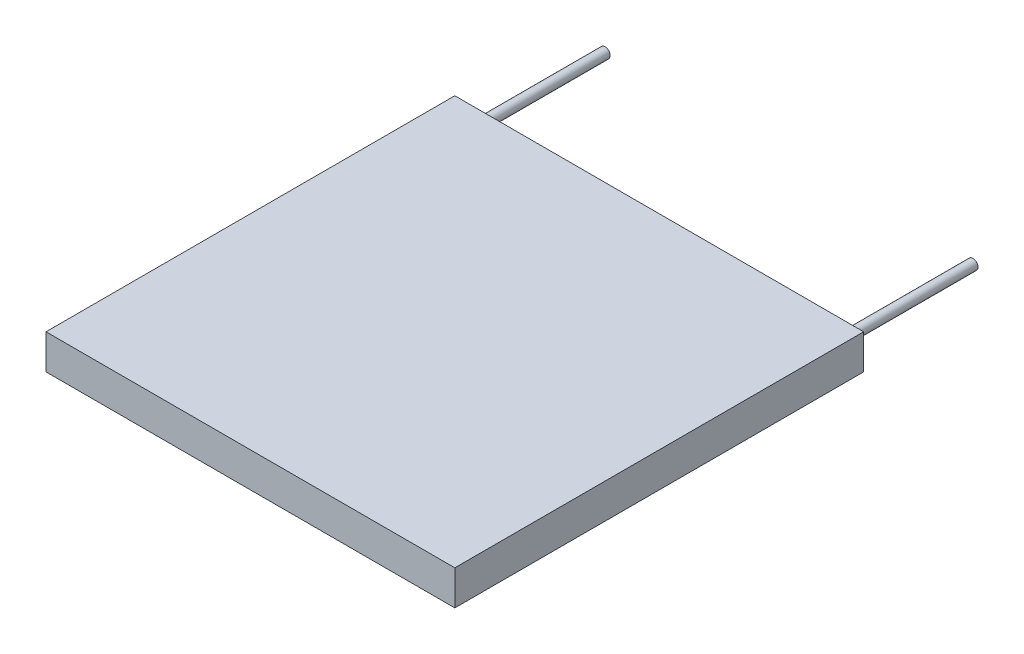
ISO-10303-21;
HEADER;
FILE_DESCRIPTION(('STEP AP214'),'2;1');
FILE_NAME('part.step','',(''),(''),'','','');
FILE_SCHEMA(('AUTOMOTIVE_DESIGN { 1 0 10303 214 1 1 1 1 }'));
ENDSEC;
DATA;
#1=APPLICATION_CONTEXT('core data for automotive mechanical design processes');
#2=APPLICATION_PROTOCOL_DEFINITION('international standard','automotive_design',2000,#1);
#3=PRODUCT_CONTEXT('',#1,'mechanical');
#4=PRODUCT('Part','Part','',(#3));
#5=PRODUCT_RELATED_PRODUCT_CATEGORY('part','',(#4));
#6=PRODUCT_DEFINITION_FORMATION('','',#4);
#7=PRODUCT_DEFINITION_CONTEXT('part definition',#1,'design');
#8=PRODUCT_DEFINITION('design','',#6,#7);
#9=PRODUCT_DEFINITION_SHAPE('','',#8);
#10=(LENGTH_UNIT() NAMED_UNIT(*) SI_UNIT(.MILLI.,.METRE.));
#11=(NAMED_UNIT(*) PLANE_ANGLE_UNIT() SI_UNIT($,.RADIAN.));
#12=(NAMED_UNIT(*) SI_UNIT($,.STERADIAN.) SOLID_ANGLE_UNIT());
#13=UNCERTAINTY_MEASURE_WITH_UNIT(LENGTH_MEASURE(1.E-05),#10,'distance_accuracy_value','');
#14=(GEOMETRIC_REPRESENTATION_CONTEXT(3) GLOBAL_UNCERTAINTY_ASSIGNED_CONTEXT((#13)) GLOBAL_UNIT_ASSIGNED_CONTEXT((#10,
#11,#12)) REPRESENTATION_CONTEXT('',''));
#15=CARTESIAN_POINT('',(0.,0.,0.));
#16=DIRECTION('',(0.,0.,1.));
#17=DIRECTION('',(1.,0.,0.));
#18=AXIS2_PLACEMENT_3D('',#15,#16,#17);
#19=CARTESIAN_POINT('',(-50.6718714377068,3.4,-27.0594687609523));
#20=DIRECTION('',(0.,0.,1.));
#21=DIRECTION('',(1.,0.,0.));
#22=AXIS2_PLACEMENT_3D('',#19,#20,#21);
#23=PLANE('',#22);
#24=CARTESIAN_POINT('',(-48.6718714377068,1.7,-27.0594687609523));
#25=DIRECTION('',(0.,0.,1.));
#26=DIRECTION('',(1.,0.,0.));
#27=AXIS2_PLACEMENT_3D('',#24,#25,#26);
#28=CIRCLE('',#27,0.499999999999999);
#29=CARTESIAN_POINT('',(-48.1718714377068,1.7,-27.0594687609523));
#30=VERTEX_POINT('',#29);
#31=EDGE_CURVE('E43',#30,#30,#28,.F.);
#32=ORIENTED_EDGE('',*,*,#31,.F.);
#33=EDGE_LOOP('',(#32));
#34=FACE_BOUND('',#33,.T.);
#35=DIRECTION('',(-1.,0.,0.));
#36=VECTOR('',#35,1.);
#37=CARTESIAN_POINT('',(-50.6718714377068,0.,-27.0594687609523));
#38=LINE('',#37,#36);
#39=CARTESIAN_POINT('',(-10.6718714377068,0.,-27.0594687609523));
#40=VERTEX_POINT('',#39);
#41=CARTESIAN_POINT('',(-50.6718714377068,0.,-27.0594687609523));
#42=VERTEX_POINT('',#41);
#43=EDGE_CURVE('E74',#40,#42,#38,.T.);
#44=ORIENTED_EDGE('',*,*,#43,.T.);
#45=DIRECTION('',(0.,-1.,0.));
#46=VECTOR('',#45,1.);
#47=CARTESIAN_POINT('',(-50.6718714377068,3.4,-27.0594687609523));
#48=LINE('',#47,#46);
#49=CARTESIAN_POINT('',(-50.6718714377068,3.4,-27.0594687609523));
#50=VERTEX_POINT('',#49);
#51=EDGE_CURVE('E98',#50,#42,#48,.T.);
#52=ORIENTED_EDGE('',*,*,#51,.F.);
#53=DIRECTION('',(-1.,0.,0.));
#54=VECTOR('',#53,1.);
#55=CARTESIAN_POINT('',(-50.6718714377068,3.4,-27.0594687609523));
#56=LINE('',#55,#54);
#57=CARTESIAN_POINT('',(-10.6718714377068,3.4,-27.0594687609523));
#58=VERTEX_POINT('',#57);
#59=EDGE_CURVE('E51',#58,#50,#56,.T.);
#60=ORIENTED_EDGE('',*,*,#59,.F.);
#61=DIRECTION('',(0.,-1.,0.));
#62=VECTOR('',#61,1.);
#63=CARTESIAN_POINT('',(-10.6718714377068,3.4,-27.0594687609523));
#64=LINE('',#63,#62);
#65=EDGE_CURVE('E94',#58,#40,#64,.T.);
#66=ORIENTED_EDGE('',*,*,#65,.T.);
#67=EDGE_LOOP('',(#44,#52,#60,#66));
#68=FACE_BOUND('',#67,.T.);
#69=CARTESIAN_POINT('',(-12.6784714377068,1.77200911665665,-27.0594687609523));
#70=DIRECTION('',(0.,0.,1.));
#71=DIRECTION('',(1.,0.,0.));
#72=AXIS2_PLACEMENT_3D('',#69,#70,#71);
#73=CIRCLE('',#72,0.495300000000001);
#74=CARTESIAN_POINT('',(-12.1831714377068,1.77200911665665,-27.0594687609523));
#75=VERTEX_POINT('',#74);
#76=EDGE_CURVE('E11',#75,#75,#73,.F.);
#77=ORIENTED_EDGE('',*,*,#76,.F.);
#78=EDGE_LOOP('',(#77));
#79=FACE_BOUND('',#78,.T.);
#80=ADVANCED_FACE('F34',(#34,#68,#79),#23,.F.);
#81=CARTESIAN_POINT('',(-50.6718714377068,3.4,-27.0594687609523));
#82=DIRECTION('',(1.,0.,0.));
#83=DIRECTION('',(0.,0.,-1.));
#84=AXIS2_PLACEMENT_3D('',#81,#82,#83);
#85=PLANE('',#84);
#86=DIRECTION('',(0.,0.,1.));
#87=VECTOR('',#86,1.);
#88=CARTESIAN_POINT('',(-50.6718714377068,0.,-27.0594687609523));
#89=LINE('',#88,#87);
#90=CARTESIAN_POINT('',(-50.6718714377068,0.,12.9405312390477));
#91=VERTEX_POINT('',#90);
#92=EDGE_CURVE('E102',#42,#91,#89,.T.);
#93=ORIENTED_EDGE('',*,*,#92,.T.);
#94=DIRECTION('',(0.,-1.,0.));
#95=VECTOR('',#94,1.);
#96=CARTESIAN_POINT('',(-50.6718714377068,3.4,12.9405312390477));
#97=LINE('',#96,#95);
#98=CARTESIAN_POINT('',(-50.6718714377068,3.4,12.9405312390477));
#99=VERTEX_POINT('',#98);
#100=EDGE_CURVE('E93',#99,#91,#97,.T.);
#101=ORIENTED_EDGE('',*,*,#100,.F.);
#102=DIRECTION('',(0.,0.,1.));
#103=VECTOR('',#102,1.);
#104=CARTESIAN_POINT('',(-50.6718714377068,3.4,-27.0594687609523));
#105=LINE('',#104,#103);
#106=EDGE_CURVE('E87',#50,#99,#105,.T.);
#107=ORIENTED_EDGE('',*,*,#106,.F.);
#108=ORIENTED_EDGE('',*,*,#51,.T.);
#109=EDGE_LOOP('',(#93,#101,#107,#108));
#110=FACE_BOUND('',#109,.T.);
#111=ADVANCED_FACE('F36',(#110),#85,.F.);
#112=CARTESIAN_POINT('',(-50.6718714377068,3.4,12.9405312390477));
#113=DIRECTION('',(0.,0.,-1.));
#114=DIRECTION('',(-1.,0.,0.));
#115=AXIS2_PLACEMENT_3D('',#112,#113,#114);
#116=PLANE('',#115);
#117=DIRECTION('',(1.,0.,0.));
#118=VECTOR('',#117,1.);
#119=CARTESIAN_POINT('',(-50.6718714377068,0.,12.9405312390477));
#120=LINE('',#119,#118);
#121=CARTESIAN_POINT('',(-10.6718714377068,0.,12.9405312390477));
#122=VERTEX_POINT('',#121);
#123=EDGE_CURVE('E92',#91,#122,#120,.T.);
#124=ORIENTED_EDGE('',*,*,#123,.T.);
#125=DIRECTION('',(0.,-1.,0.));
#126=VECTOR('',#125,1.);
#127=CARTESIAN_POINT('',(-10.6718714377068,3.4,12.9405312390477));
#128=LINE('',#127,#126);
#129=CARTESIAN_POINT('',(-10.6718714377068,3.4,12.9405312390477));
#130=VERTEX_POINT('',#129);
#131=EDGE_CURVE('E90',#130,#122,#128,.T.);
#132=ORIENTED_EDGE('',*,*,#131,.F.);
#133=DIRECTION('',(1.,0.,0.));
#134=VECTOR('',#133,1.);
#135=CARTESIAN_POINT('',(-50.6718714377068,3.4,12.9405312390477));
#136=LINE('',#135,#134);
#137=EDGE_CURVE('E82',#99,#130,#136,.T.);
#138=ORIENTED_EDGE('',*,*,#137,.F.);
#139=ORIENTED_EDGE('',*,*,#100,.T.);
#140=EDGE_LOOP('',(#124,#132,#138,#139));
#141=FACE_BOUND('',#140,.T.);
#142=ADVANCED_FACE('F91',(#141),#116,.F.);
#143=CARTESIAN_POINT('',(-10.6718714377068,3.4,-27.0594687609523));
#144=DIRECTION('',(-1.,0.,0.));
#145=DIRECTION('',(0.,0.,1.));
#146=AXIS2_PLACEMENT_3D('',#143,#144,#145);
#147=PLANE('',#146);
#148=DIRECTION('',(0.,0.,-1.));
#149=VECTOR('',#148,1.);
#150=CARTESIAN_POINT('',(-10.6718714377068,0.,-27.0594687609523));
#151=LINE('',#150,#149);
#152=EDGE_CURVE('E68',#122,#40,#151,.T.);
#153=ORIENTED_EDGE('',*,*,#152,.T.);
#154=ORIENTED_EDGE('',*,*,#65,.F.);
#155=DIRECTION('',(0.,0.,-1.));
#156=VECTOR('',#155,1.);
#157=CARTESIAN_POINT('',(-10.6718714377068,3.4,-27.0594687609523));
#158=LINE('',#157,#156);
#159=EDGE_CURVE('E85',#130,#58,#158,.T.);
#160=ORIENTED_EDGE('',*,*,#159,.F.);
#161=ORIENTED_EDGE('',*,*,#131,.T.);
#162=EDGE_LOOP('',(#153,#154,#160,#161));
#163=FACE_BOUND('',#162,.T.);
#164=ADVANCED_FACE('F96',(#163),#147,.F.);
#165=CARTESIAN_POINT('',(-50.6718714377068,3.4,12.9405312390477));
#166=DIRECTION('',(0.,1.,0.));
#167=DIRECTION('',(0.,0.,1.));
#168=AXIS2_PLACEMENT_3D('',#165,#166,#167);
#169=PLANE('',#168);
#170=ORIENTED_EDGE('',*,*,#106,.T.);
#171=ORIENTED_EDGE('',*,*,#137,.T.);
#172=ORIENTED_EDGE('',*,*,#159,.T.);
#173=ORIENTED_EDGE('',*,*,#59,.T.);
#174=EDGE_LOOP('',(#170,#171,#172,#173));
#175=FACE_BOUND('',#174,.T.);
#176=ADVANCED_FACE('F83',(#175),#169,.T.);
#177=CARTESIAN_POINT('',(-50.6718714377068,0.,12.9405312390477));
#178=DIRECTION('',(0.,1.,0.));
#179=DIRECTION('',(0.,0.,1.));
#180=AXIS2_PLACEMENT_3D('',#177,#178,#179);
#181=PLANE('',#180);
#182=ORIENTED_EDGE('',*,*,#92,.F.);
#183=ORIENTED_EDGE('',*,*,#43,.F.);
#184=ORIENTED_EDGE('',*,*,#152,.F.);
#185=ORIENTED_EDGE('',*,*,#123,.F.);
#186=EDGE_LOOP('',(#182,#183,#184,#185));
#187=FACE_BOUND('',#186,.T.);
#188=ADVANCED_FACE('F139',(#187),#181,.F.);
#189=CARTESIAN_POINT('',(-48.6718714377068,1.7,-39.7594687609523));
#190=DIRECTION('',(0.,0.,1.));
#191=DIRECTION('',(1.,0.,0.));
#192=AXIS2_PLACEMENT_3D('',#189,#190,#191);
#193=CYLINDRICAL_SURFACE('',#192,0.499999999999999);
#194=CARTESIAN_POINT('',(-48.6718714377068,1.7,-39.7594687609523));
#195=DIRECTION('',(0.,0.,-1.));
#196=DIRECTION('',(-1.,0.,0.));
#197=AXIS2_PLACEMENT_3D('',#194,#195,#196);
#198=CIRCLE('',#197,0.499999999999999);
#199=CARTESIAN_POINT('',(-49.1718714377068,1.7,-39.7594687609523));
#200=VERTEX_POINT('',#199);
#201=EDGE_CURVE('E105',#200,#200,#198,.T.);
#202=ORIENTED_EDGE('',*,*,#201,.F.);
#203=EDGE_LOOP('',(#202));
#204=FACE_BOUND('',#203,.T.);
#205=ORIENTED_EDGE('',*,*,#31,.T.);
#206=EDGE_LOOP('',(#205));
#207=FACE_BOUND('',#206,.T.);
#208=ADVANCED_FACE('F114',(#204,#207),#193,.T.);
#209=CARTESIAN_POINT('',(-48.6718714377068,1.7,-39.7594687609523));
#210=DIRECTION('',(0.,0.,-1.));
#211=DIRECTION('',(-1.,0.,0.));
#212=AXIS2_PLACEMENT_3D('',#209,#210,#211);
#213=PLANE('',#212);
#214=ORIENTED_EDGE('',*,*,#201,.T.);
#215=EDGE_LOOP('',(#214));
#216=FACE_BOUND('',#215,.T.);
#217=ADVANCED_FACE('F124',(#216),#213,.T.);
#218=CARTESIAN_POINT('',(-12.6784714377068,1.77200911665665,-39.7594687609523));
#219=DIRECTION('',(0.,0.,1.));
#220=DIRECTION('',(1.,0.,0.));
#221=AXIS2_PLACEMENT_3D('',#218,#219,#220);
#222=CYLINDRICAL_SURFACE('',#221,0.495300000000001);
#223=CARTESIAN_POINT('',(-12.6784714377068,1.77200911665665,-39.7594687609523));
#224=DIRECTION('',(0.,0.,-1.));
#225=DIRECTION('',(-1.,0.,0.));
#226=AXIS2_PLACEMENT_3D('',#223,#224,#225);
#227=CIRCLE('',#226,0.495300000000001);
#228=CARTESIAN_POINT('',(-13.1737714377068,1.77200911665665,-39.7594687609523));
#229=VERTEX_POINT('',#228);
#230=EDGE_CURVE('E158',#229,#229,#227,.T.);
#231=ORIENTED_EDGE('',*,*,#230,.F.);
#232=EDGE_LOOP('',(#231));
#233=FACE_BOUND('',#232,.T.);
#234=ORIENTED_EDGE('',*,*,#76,.T.);
#235=EDGE_LOOP('',(#234));
#236=FACE_BOUND('',#235,.T.);
#237=ADVANCED_FACE('F121',(#233,#236),#222,.T.);
#238=CARTESIAN_POINT('',(-12.6784714377068,1.77200911665665,-39.7594687609523));
#239=DIRECTION('',(0.,0.,-1.));
#240=DIRECTION('',(-1.,0.,0.));
#241=AXIS2_PLACEMENT_3D('',#238,#239,#240);
#242=PLANE('',#241);
#243=ORIENTED_EDGE('',*,*,#230,.T.);
#244=EDGE_LOOP('',(#243));
#245=FACE_BOUND('',#244,.T.);
#246=ADVANCED_FACE('F123',(#245),#242,.T.);
#247=CLOSED_SHELL('',(#80,#111,#142,#164,#176,#188,#208,#217,#237,#246));
#248=MANIFOLD_SOLID_BREP('B2',#247);
#249=ADVANCED_BREP_SHAPE_REPRESENTATION('',(#18,#248),#14);
#250=SHAPE_DEFINITION_REPRESENTATION(#9,#249);
ENDSEC;
END-ISO-10303-21;
